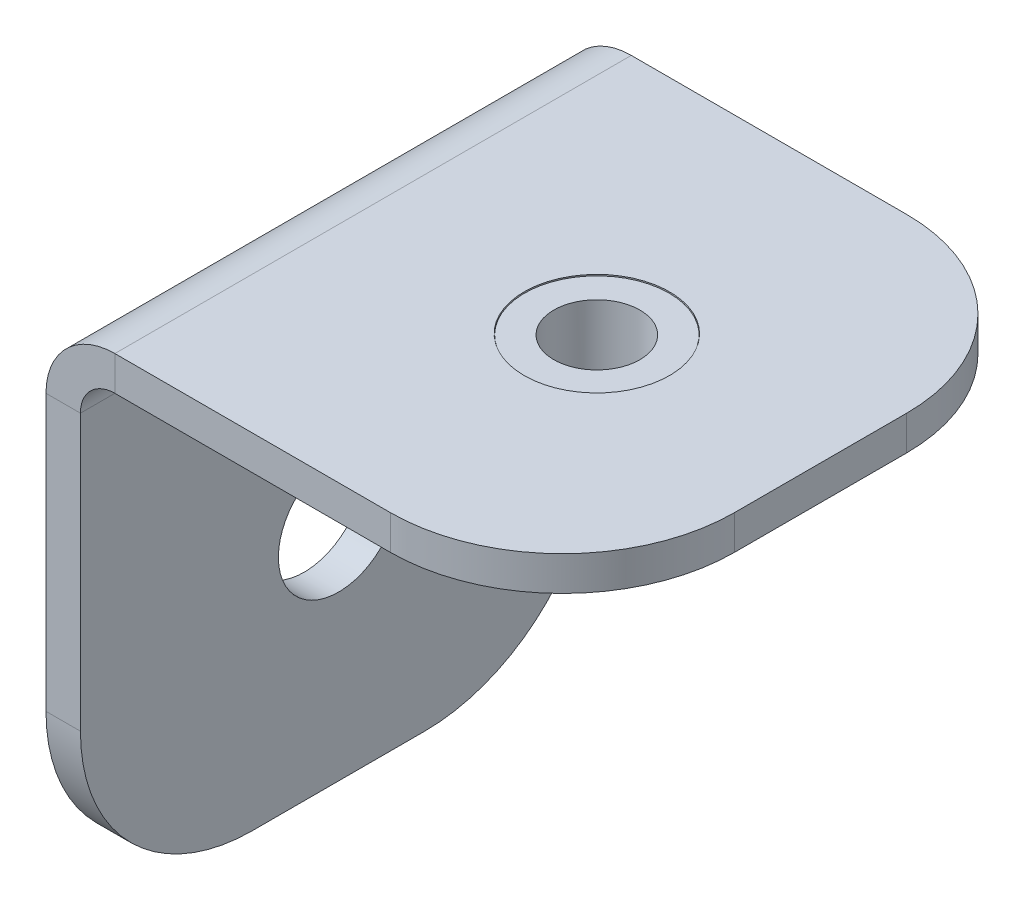
ISO-10303-21;
HEADER;
FILE_DESCRIPTION(('STEP AP214'),'2;1');
FILE_NAME('part.step','',(''),(''),'','','');
FILE_SCHEMA(('AUTOMOTIVE_DESIGN { 1 0 10303 214 1 1 1 1 }'));
ENDSEC;
DATA;
#1=APPLICATION_CONTEXT('core data for automotive mechanical design processes');
#2=APPLICATION_PROTOCOL_DEFINITION('international standard','automotive_design',2000,#1);
#3=PRODUCT_CONTEXT('',#1,'mechanical');
#4=PRODUCT('Part','Part','',(#3));
#5=PRODUCT_RELATED_PRODUCT_CATEGORY('part','',(#4));
#6=PRODUCT_DEFINITION_FORMATION('','',#4);
#7=PRODUCT_DEFINITION_CONTEXT('part definition',#1,'design');
#8=PRODUCT_DEFINITION('design','',#6,#7);
#9=PRODUCT_DEFINITION_SHAPE('','',#8);
#10=(LENGTH_UNIT() NAMED_UNIT(*) SI_UNIT(.MILLI.,.METRE.));
#11=(NAMED_UNIT(*) PLANE_ANGLE_UNIT() SI_UNIT($,.RADIAN.));
#12=(NAMED_UNIT(*) SI_UNIT($,.STERADIAN.) SOLID_ANGLE_UNIT());
#13=UNCERTAINTY_MEASURE_WITH_UNIT(LENGTH_MEASURE(1.E-05),#10,'distance_accuracy_value','');
#14=(GEOMETRIC_REPRESENTATION_CONTEXT(3) GLOBAL_UNCERTAINTY_ASSIGNED_CONTEXT((#13)) GLOBAL_UNIT_ASSIGNED_CONTEXT((#10,
#11,#12)) REPRESENTATION_CONTEXT('',''));
#15=CARTESIAN_POINT('',(0.,0.,0.));
#16=DIRECTION('',(0.,0.,1.));
#17=DIRECTION('',(1.,0.,0.));
#18=AXIS2_PLACEMENT_3D('',#15,#16,#17);
#19=CARTESIAN_POINT('',(8.5,12.5,7.5));
#20=DIRECTION('',(0.,1.,0.));
#21=DIRECTION('',(0.837169104331222,0.,0.546944138603989));
#22=AXIS2_PLACEMENT_3D('',#19,#20,#21);
#23=PLANE('',#22);
#24=CARTESIAN_POINT('',(8.5,12.5,7.5));
#25=DIRECTION('',(0.,-1.,0.));
#26=DIRECTION('',(0.546944138603989,0.,-0.837169104331222));
#27=AXIS2_PLACEMENT_3D('',#24,#25,#26);
#28=CIRCLE('',#27,1.24999999999999);
#29=CARTESIAN_POINT('',(9.18368017325498,12.5,6.45353861958598));
#30=VERTEX_POINT('',#29);
#31=EDGE_CURVE('E69',#30,#30,#28,.T.);
#32=ORIENTED_EDGE('',*,*,#31,.F.);
#33=EDGE_LOOP('',(#32));
#34=FACE_BOUND('',#33,.T.);
#35=CARTESIAN_POINT('',(8.5,12.5,7.5));
#36=DIRECTION('',(0.,-1.,0.));
#37=DIRECTION('',(-0.837169104331222,0.,-0.546944138603989));
#38=AXIS2_PLACEMENT_3D('',#35,#36,#37);
#39=CIRCLE('',#38,3.15);
#40=CARTESIAN_POINT('',(5.86291732135665,12.5,5.77712596339744));
#41=VERTEX_POINT('',#40);
#42=EDGE_CURVE('E11',#41,#41,#39,.T.);
#43=ORIENTED_EDGE('',*,*,#42,.T.);
#44=EDGE_LOOP('',(#43));
#45=FACE_BOUND('',#44,.T.);
#46=ADVANCED_FACE('F47',(#34,#45),#23,.F.);
#47=CARTESIAN_POINT('',(8.5,12.5,7.5));
#48=DIRECTION('',(0.,-1.,0.));
#49=DIRECTION('',(-0.837169104331222,0.,-0.546944138603989));
#50=AXIS2_PLACEMENT_3D('',#47,#48,#49);
#51=CYLINDRICAL_SURFACE('',#50,3.15);
#52=ORIENTED_EDGE('',*,*,#42,.F.);
#53=EDGE_LOOP('',(#52));
#54=FACE_BOUND('',#53,.T.);
#55=CARTESIAN_POINT('',(8.5,14.,7.5));
#56=DIRECTION('',(0.,-1.,0.));
#57=DIRECTION('',(-0.837169104331222,0.,-0.546944138603989));
#58=AXIS2_PLACEMENT_3D('',#55,#56,#57);
#59=CIRCLE('',#58,3.15);
#60=CARTESIAN_POINT('',(5.86291732135665,14.,5.77712596339744));
#61=VERTEX_POINT('',#60);
#62=EDGE_CURVE('E53',#61,#61,#59,.T.);
#63=ORIENTED_EDGE('',*,*,#62,.T.);
#64=EDGE_LOOP('',(#63));
#65=FACE_BOUND('',#64,.T.);
#66=ADVANCED_FACE('F77',(#54,#65),#51,.T.);
#67=CARTESIAN_POINT('',(11.1370826786433,14.,9.22287403660256));
#68=DIRECTION('',(0.,-1.,0.));
#69=DIRECTION('',(-0.837169104331222,0.,-0.546944138603989));
#70=AXIS2_PLACEMENT_3D('',#67,#68,#69);
#71=PLANE('',#70);
#72=ORIENTED_EDGE('',*,*,#62,.F.);
#73=EDGE_LOOP('',(#72));
#74=FACE_BOUND('',#73,.T.);
#75=CARTESIAN_POINT('',(8.5,14.,7.5));
#76=DIRECTION('',(0.,-1.,0.));
#77=DIRECTION('',(-0.837169104331222,0.,-0.546944138603989));
#78=AXIS2_PLACEMENT_3D('',#75,#76,#77);
#79=CIRCLE('',#78,2.1);
#80=CARTESIAN_POINT('',(6.74194488090443,14.,6.35141730893162));
#81=VERTEX_POINT('',#80);
#82=EDGE_CURVE('E57',#81,#81,#79,.T.);
#83=ORIENTED_EDGE('',*,*,#82,.T.);
#84=EDGE_LOOP('',(#83));
#85=FACE_BOUND('',#84,.T.);
#86=ADVANCED_FACE('F81',(#74,#85),#71,.F.);
#87=CARTESIAN_POINT('',(8.5,12.5,7.5));
#88=DIRECTION('',(0.,-1.,0.));
#89=DIRECTION('',(-0.837169104331222,0.,-0.546944138603989));
#90=AXIS2_PLACEMENT_3D('',#87,#88,#89);
#91=CYLINDRICAL_SURFACE('',#90,2.1);
#92=ORIENTED_EDGE('',*,*,#82,.F.);
#93=EDGE_LOOP('',(#92));
#94=FACE_BOUND('',#93,.T.);
#95=CARTESIAN_POINT('',(8.5,14.97,7.5));
#96=DIRECTION('',(0.,-1.,0.));
#97=DIRECTION('',(-0.837169104331222,0.,-0.546944138603989));
#98=AXIS2_PLACEMENT_3D('',#95,#96,#97);
#99=CIRCLE('',#98,2.1);
#100=CARTESIAN_POINT('',(6.74194488090443,14.97,6.35141730893162));
#101=VERTEX_POINT('',#100);
#102=EDGE_CURVE('E61',#101,#101,#99,.T.);
#103=ORIENTED_EDGE('',*,*,#102,.T.);
#104=EDGE_LOOP('',(#103));
#105=FACE_BOUND('',#104,.T.);
#106=ADVANCED_FACE('F86',(#94,#105),#91,.T.);
#107=CARTESIAN_POINT('',(10.2580551190956,14.97,8.64858269106838));
#108=DIRECTION('',(0.,-1.,0.));
#109=DIRECTION('',(-0.837169104331222,0.,-0.546944138603989));
#110=AXIS2_PLACEMENT_3D('',#107,#108,#109);
#111=PLANE('',#110);
#112=CARTESIAN_POINT('',(8.5,14.97,7.5));
#113=DIRECTION('',(0.,-1.,0.));
#114=DIRECTION('',(-0.837169104331222,0.,-0.546944138603989));
#115=AXIS2_PLACEMENT_3D('',#112,#113,#114);
#116=CIRCLE('',#115,1.24999999999999);
#117=CARTESIAN_POINT('',(7.45353861958598,14.97,6.81631982674502));
#118=VERTEX_POINT('',#117);
#119=EDGE_CURVE('E66',#118,#118,#116,.T.);
#120=ORIENTED_EDGE('',*,*,#119,.T.);
#121=EDGE_LOOP('',(#120));
#122=FACE_BOUND('',#121,.T.);
#123=ORIENTED_EDGE('',*,*,#102,.F.);
#124=EDGE_LOOP('',(#123));
#125=FACE_BOUND('',#124,.T.);
#126=ADVANCED_FACE('F92',(#122,#125),#111,.F.);
#127=CARTESIAN_POINT('',(8.5,12.5,7.5));
#128=DIRECTION('',(0.,-1.,0.));
#129=DIRECTION('',(0.546944138603989,0.,-0.837169104331222));
#130=AXIS2_PLACEMENT_3D('',#127,#128,#129);
#131=CYLINDRICAL_SURFACE('',#130,1.24999999999999);
#132=ORIENTED_EDGE('',*,*,#31,.T.);
#133=EDGE_LOOP('',(#132));
#134=FACE_BOUND('',#133,.T.);
#135=ORIENTED_EDGE('',*,*,#119,.F.);
#136=EDGE_LOOP('',(#135));
#137=FACE_BOUND('',#136,.T.);
#138=ADVANCED_FACE('F73',(#134,#137),#131,.F.);
#139=CLOSED_SHELL('',(#46,#66,#86,#106,#126,#138));
#140=MANIFOLD_SOLID_BREP('B2',#139);
#141=CARTESIAN_POINT('',(2.,15.,15.));
#142=DIRECTION('',(0.,0.,1.));
#143=DIRECTION('',(1.,0.,0.));
#144=AXIS2_PLACEMENT_3D('',#141,#142,#143);
#145=PLANE('',#144);
#146=DIRECTION('',(0.,-1.,0.));
#147=VECTOR('',#146,1.);
#148=CARTESIAN_POINT('',(2.,15.,15.));
#149=LINE('',#148,#147);
#150=CARTESIAN_POINT('',(2.,15.,15.));
#151=VERTEX_POINT('',#150);
#152=CARTESIAN_POINT('',(2.,14.,15.));
#153=VERTEX_POINT('',#152);
#154=EDGE_CURVE('E243',#151,#153,#149,.T.);
#155=ORIENTED_EDGE('',*,*,#154,.F.);
#156=CARTESIAN_POINT('',(2.,13.,15.));
#157=DIRECTION('',(0.,0.,1.));
#158=DIRECTION('',(1.,0.,0.));
#159=AXIS2_PLACEMENT_3D('',#156,#157,#158);
#160=CIRCLE('',#159,2.);
#161=CARTESIAN_POINT('',(0.,13.,15.));
#162=VERTEX_POINT('',#161);
#163=EDGE_CURVE('E247',#162,#151,#160,.F.);
#164=ORIENTED_EDGE('',*,*,#163,.F.);
#165=DIRECTION('',(-1.,0.,0.));
#166=VECTOR('',#165,1.);
#167=CARTESIAN_POINT('',(1.,13.,15.));
#168=LINE('',#167,#166);
#169=CARTESIAN_POINT('',(1.,13.,15.));
#170=VERTEX_POINT('',#169);
#171=EDGE_CURVE('E252',#170,#162,#168,.T.);
#172=ORIENTED_EDGE('',*,*,#171,.F.);
#173=CARTESIAN_POINT('',(2.,13.,15.));
#174=DIRECTION('',(0.,0.,1.));
#175=DIRECTION('',(1.,0.,0.));
#176=AXIS2_PLACEMENT_3D('',#173,#174,#175);
#177=CIRCLE('',#176,1.);
#178=EDGE_CURVE('E249',#170,#153,#177,.F.);
#179=ORIENTED_EDGE('',*,*,#178,.T.);
#180=EDGE_LOOP('',(#155,#164,#172,#179));
#181=FACE_BOUND('',#180,.T.);
#182=ADVANCED_FACE('F150',(#181),#145,.T.);
#183=CARTESIAN_POINT('',(1.,13.,15.));
#184=DIRECTION('',(0.,0.,1.));
#185=DIRECTION('',(1.,0.,0.));
#186=AXIS2_PLACEMENT_3D('',#183,#184,#185);
#187=PLANE('',#186);
#188=DIRECTION('',(1.,0.,0.));
#189=VECTOR('',#188,1.);
#190=CARTESIAN_POINT('',(0.,14.,15.));
#191=LINE('',#190,#189);
#192=CARTESIAN_POINT('',(10.,14.,15.));
#193=VERTEX_POINT('',#192);
#194=EDGE_CURVE('E267',#153,#193,#191,.T.);
#195=ORIENTED_EDGE('',*,*,#194,.T.);
#196=DIRECTION('',(0.,-1.,0.));
#197=VECTOR('',#196,1.);
#198=CARTESIAN_POINT('',(10.,13.,15.));
#199=LINE('',#198,#197);
#200=CARTESIAN_POINT('',(10.,15.,15.));
#201=VERTEX_POINT('',#200);
#202=EDGE_CURVE('E173',#193,#201,#199,.F.);
#203=ORIENTED_EDGE('',*,*,#202,.T.);
#204=DIRECTION('',(1.,0.,0.));
#205=VECTOR('',#204,1.);
#206=CARTESIAN_POINT('',(0.,15.,15.));
#207=LINE('',#206,#205);
#208=EDGE_CURVE('E257',#151,#201,#207,.T.);
#209=ORIENTED_EDGE('',*,*,#208,.F.);
#210=ORIENTED_EDGE('',*,*,#154,.T.);
#211=EDGE_LOOP('',(#195,#203,#209,#210));
#212=FACE_BOUND('',#211,.T.);
#213=ADVANCED_FACE('F266',(#212),#187,.T.);
#214=CARTESIAN_POINT('',(0.,13.,0.));
#215=DIRECTION('',(0.,0.,-1.));
#216=DIRECTION('',(-1.,0.,0.));
#217=AXIS2_PLACEMENT_3D('',#214,#215,#216);
#218=PLANE('',#217);
#219=DIRECTION('',(1.,0.,0.));
#220=VECTOR('',#219,1.);
#221=CARTESIAN_POINT('',(0.,13.,0.));
#222=LINE('',#221,#220);
#223=CARTESIAN_POINT('',(0.,13.,0.));
#224=VERTEX_POINT('',#223);
#225=CARTESIAN_POINT('',(1.,13.,0.));
#226=VERTEX_POINT('',#225);
#227=EDGE_CURVE('E313',#224,#226,#222,.T.);
#228=ORIENTED_EDGE('',*,*,#227,.F.);
#229=CARTESIAN_POINT('',(2.,13.,0.));
#230=DIRECTION('',(0.,0.,1.));
#231=DIRECTION('',(1.,0.,0.));
#232=AXIS2_PLACEMENT_3D('',#229,#230,#231);
#233=CIRCLE('',#232,2.);
#234=CARTESIAN_POINT('',(2.,15.,0.));
#235=VERTEX_POINT('',#234);
#236=EDGE_CURVE('E286',#224,#235,#233,.F.);
#237=ORIENTED_EDGE('',*,*,#236,.T.);
#238=DIRECTION('',(0.,1.,0.));
#239=VECTOR('',#238,1.);
#240=CARTESIAN_POINT('',(2.,14.,0.));
#241=LINE('',#240,#239);
#242=CARTESIAN_POINT('',(2.,14.,0.));
#243=VERTEX_POINT('',#242);
#244=EDGE_CURVE('E311',#243,#235,#241,.T.);
#245=ORIENTED_EDGE('',*,*,#244,.F.);
#246=CARTESIAN_POINT('',(2.,13.,0.));
#247=DIRECTION('',(0.,0.,1.));
#248=DIRECTION('',(1.,0.,0.));
#249=AXIS2_PLACEMENT_3D('',#246,#247,#248);
#250=CIRCLE('',#249,1.);
#251=EDGE_CURVE('E292',#226,#243,#250,.F.);
#252=ORIENTED_EDGE('',*,*,#251,.F.);
#253=EDGE_LOOP('',(#228,#237,#245,#252));
#254=FACE_BOUND('',#253,.T.);
#255=ADVANCED_FACE('F360',(#254),#218,.T.);
#256=CARTESIAN_POINT('',(2.,14.,0.));
#257=DIRECTION('',(0.,0.,-1.));
#258=DIRECTION('',(-1.,0.,0.));
#259=AXIS2_PLACEMENT_3D('',#256,#257,#258);
#260=PLANE('',#259);
#261=DIRECTION('',(0.,1.,0.));
#262=VECTOR('',#261,1.);
#263=CARTESIAN_POINT('',(1.,0.,0.));
#264=LINE('',#263,#262);
#265=CARTESIAN_POINT('',(1.,5.,0.));
#266=VERTEX_POINT('',#265);
#267=EDGE_CURVE('E290',#266,#226,#264,.T.);
#268=ORIENTED_EDGE('',*,*,#267,.F.);
#269=DIRECTION('',(-1.,0.,0.));
#270=VECTOR('',#269,1.);
#271=CARTESIAN_POINT('',(2.,5.,0.));
#272=LINE('',#271,#270);
#273=CARTESIAN_POINT('',(0.,5.,0.));
#274=VERTEX_POINT('',#273);
#275=EDGE_CURVE('E45',#266,#274,#272,.T.);
#276=ORIENTED_EDGE('',*,*,#275,.T.);
#277=DIRECTION('',(0.,1.,0.));
#278=VECTOR('',#277,1.);
#279=CARTESIAN_POINT('',(0.,0.,0.));
#280=LINE('',#279,#278);
#281=EDGE_CURVE('E288',#274,#224,#280,.T.);
#282=ORIENTED_EDGE('',*,*,#281,.T.);
#283=ORIENTED_EDGE('',*,*,#227,.T.);
#284=EDGE_LOOP('',(#268,#276,#282,#283));
#285=FACE_BOUND('',#284,.T.);
#286=ADVANCED_FACE('F377',(#285),#260,.T.);
#287=CARTESIAN_POINT('',(0.,14.,15.));
#288=DIRECTION('',(0.,1.,0.));
#289=DIRECTION('',(0.,0.,1.));
#290=AXIS2_PLACEMENT_3D('',#287,#288,#289);
#291=PLANE('',#290);
#292=CARTESIAN_POINT('',(8.5,14.,7.5));
#293=DIRECTION('',(0.,1.,0.));
#294=DIRECTION('',(0.,0.,1.));
#295=AXIS2_PLACEMENT_3D('',#292,#293,#294);
#296=CIRCLE('',#295,2.11);
#297=CARTESIAN_POINT('',(8.5,14.,9.61));
#298=VERTEX_POINT('',#297);
#299=EDGE_CURVE('E284',#298,#298,#296,.F.);
#300=ORIENTED_EDGE('',*,*,#299,.F.);
#301=EDGE_LOOP('',(#300));
#302=FACE_BOUND('',#301,.T.);
#303=DIRECTION('',(0.,0.,-1.));
#304=VECTOR('',#303,1.);
#305=CARTESIAN_POINT('',(15.,14.,15.));
#306=LINE('',#305,#304);
#307=CARTESIAN_POINT('',(15.,14.,10.));
#308=VERTEX_POINT('',#307);
#309=CARTESIAN_POINT('',(15.,14.,5.));
#310=VERTEX_POINT('',#309);
#311=EDGE_CURVE('E308',#308,#310,#306,.T.);
#312=ORIENTED_EDGE('',*,*,#311,.F.);
#313=CARTESIAN_POINT('',(10.,14.,10.));
#314=DIRECTION('',(0.,1.,0.));
#315=DIRECTION('',(0.,0.,1.));
#316=AXIS2_PLACEMENT_3D('',#313,#314,#315);
#317=CIRCLE('',#316,5.);
#318=EDGE_CURVE('E339',#308,#193,#317,.F.);
#319=ORIENTED_EDGE('',*,*,#318,.T.);
#320=ORIENTED_EDGE('',*,*,#194,.F.);
#321=DIRECTION('',(0.,0.,-1.));
#322=VECTOR('',#321,1.);
#323=CARTESIAN_POINT('',(2.,14.,15.));
#324=LINE('',#323,#322);
#325=EDGE_CURVE('E280',#153,#243,#324,.T.);
#326=ORIENTED_EDGE('',*,*,#325,.T.);
#327=DIRECTION('',(1.,0.,0.));
#328=VECTOR('',#327,1.);
#329=CARTESIAN_POINT('',(0.,14.,0.));
#330=LINE('',#329,#328);
#331=CARTESIAN_POINT('',(10.,14.,0.));
#332=VERTEX_POINT('',#331);
#333=EDGE_CURVE('E281',#243,#332,#330,.T.);
#334=ORIENTED_EDGE('',*,*,#333,.T.);
#335=CARTESIAN_POINT('',(10.,14.,5.));
#336=DIRECTION('',(0.,1.,0.));
#337=DIRECTION('',(0.,0.,1.));
#338=AXIS2_PLACEMENT_3D('',#335,#336,#337);
#339=CIRCLE('',#338,5.);
#340=EDGE_CURVE('E337',#332,#310,#339,.F.);
#341=ORIENTED_EDGE('',*,*,#340,.T.);
#342=EDGE_LOOP('',(#312,#319,#320,#326,#334,#341));
#343=FACE_BOUND('',#342,.T.);
#344=ADVANCED_FACE('F352',(#302,#343),#291,.F.);
#345=CARTESIAN_POINT('',(15.,15.,15.));
#346=DIRECTION('',(1.,0.,0.));
#347=DIRECTION('',(0.,0.,-1.));
#348=AXIS2_PLACEMENT_3D('',#345,#346,#347);
#349=PLANE('',#348);
#350=DIRECTION('',(0.,0.,-1.));
#351=VECTOR('',#350,1.);
#352=CARTESIAN_POINT('',(15.,15.,15.));
#353=LINE('',#352,#351);
#354=CARTESIAN_POINT('',(15.,15.,10.));
#355=VERTEX_POINT('',#354);
#356=CARTESIAN_POINT('',(15.,15.,5.));
#357=VERTEX_POINT('',#356);
#358=EDGE_CURVE('E263',#355,#357,#353,.T.);
#359=ORIENTED_EDGE('',*,*,#358,.F.);
#360=DIRECTION('',(0.,-1.,0.));
#361=VECTOR('',#360,1.);
#362=CARTESIAN_POINT('',(15.,15.,10.));
#363=LINE('',#362,#361);
#364=EDGE_CURVE('E334',#355,#308,#363,.T.);
#365=ORIENTED_EDGE('',*,*,#364,.T.);
#366=ORIENTED_EDGE('',*,*,#311,.T.);
#367=DIRECTION('',(0.,-1.,0.));
#368=VECTOR('',#367,1.);
#369=CARTESIAN_POINT('',(15.,15.,5.));
#370=LINE('',#369,#368);
#371=EDGE_CURVE('E332',#310,#357,#370,.F.);
#372=ORIENTED_EDGE('',*,*,#371,.T.);
#373=EDGE_LOOP('',(#359,#365,#366,#372));
#374=FACE_BOUND('',#373,.T.);
#375=ADVANCED_FACE('F413',(#374),#349,.T.);
#376=CARTESIAN_POINT('',(0.,15.,15.));
#377=DIRECTION('',(0.,1.,0.));
#378=DIRECTION('',(0.,0.,1.));
#379=AXIS2_PLACEMENT_3D('',#376,#377,#378);
#380=PLANE('',#379);
#381=CARTESIAN_POINT('',(8.5,15.,7.5));
#382=DIRECTION('',(0.,1.,0.));
#383=DIRECTION('',(0.,0.,1.));
#384=AXIS2_PLACEMENT_3D('',#381,#382,#383);
#385=CIRCLE('',#384,2.11);
#386=CARTESIAN_POINT('',(8.5,15.,9.61));
#387=VERTEX_POINT('',#386);
#388=EDGE_CURVE('E444',#387,#387,#385,.T.);
#389=ORIENTED_EDGE('',*,*,#388,.F.);
#390=EDGE_LOOP('',(#389));
#391=FACE_BOUND('',#390,.T.);
#392=ORIENTED_EDGE('',*,*,#208,.T.);
#393=CARTESIAN_POINT('',(10.,15.,10.));
#394=DIRECTION('',(0.,1.,0.));
#395=DIRECTION('',(0.,0.,1.));
#396=AXIS2_PLACEMENT_3D('',#393,#394,#395);
#397=CIRCLE('',#396,5.);
#398=EDGE_CURVE('E343',#201,#355,#397,.T.);
#399=ORIENTED_EDGE('',*,*,#398,.T.);
#400=ORIENTED_EDGE('',*,*,#358,.T.);
#401=CARTESIAN_POINT('',(10.,15.,5.));
#402=DIRECTION('',(0.,1.,0.));
#403=DIRECTION('',(0.,0.,1.));
#404=AXIS2_PLACEMENT_3D('',#401,#402,#403);
#405=CIRCLE('',#404,5.);
#406=CARTESIAN_POINT('',(10.,15.,0.));
#407=VERTEX_POINT('',#406);
#408=EDGE_CURVE('E165',#357,#407,#405,.T.);
#409=ORIENTED_EDGE('',*,*,#408,.T.);
#410=DIRECTION('',(1.,0.,0.));
#411=VECTOR('',#410,1.);
#412=CARTESIAN_POINT('',(0.,15.,0.));
#413=LINE('',#412,#411);
#414=EDGE_CURVE('E259',#235,#407,#413,.T.);
#415=ORIENTED_EDGE('',*,*,#414,.F.);
#416=DIRECTION('',(0.,0.,-1.));
#417=VECTOR('',#416,1.);
#418=CARTESIAN_POINT('',(2.,15.,15.));
#419=LINE('',#418,#417);
#420=EDGE_CURVE('E255',#151,#235,#419,.T.);
#421=ORIENTED_EDGE('',*,*,#420,.F.);
#422=EDGE_LOOP('',(#392,#399,#400,#409,#415,#421));
#423=FACE_BOUND('',#422,.T.);
#424=ADVANCED_FACE('F256',(#391,#423),#380,.T.);
#425=CARTESIAN_POINT('',(2.,13.,15.));
#426=DIRECTION('',(0.,0.,-1.));
#427=DIRECTION('',(-1.,0.,0.));
#428=AXIS2_PLACEMENT_3D('',#425,#426,#427);
#429=CYLINDRICAL_SURFACE('',#428,2.);
#430=ORIENTED_EDGE('',*,*,#236,.F.);
#431=DIRECTION('',(0.,0.,-1.));
#432=VECTOR('',#431,1.);
#433=CARTESIAN_POINT('',(0.,13.,15.));
#434=LINE('',#433,#432);
#435=EDGE_CURVE('E264',#162,#224,#434,.T.);
#436=ORIENTED_EDGE('',*,*,#435,.F.);
#437=ORIENTED_EDGE('',*,*,#163,.T.);
#438=ORIENTED_EDGE('',*,*,#420,.T.);
#439=EDGE_LOOP('',(#430,#436,#437,#438));
#440=FACE_BOUND('',#439,.T.);
#441=ADVANCED_FACE('F270',(#440),#429,.T.);
#442=CARTESIAN_POINT('',(0.,0.,15.));
#443=DIRECTION('',(-1.,0.,0.));
#444=DIRECTION('',(0.,0.,1.));
#445=AXIS2_PLACEMENT_3D('',#442,#443,#444);
#446=PLANE('',#445);
#447=CARTESIAN_POINT('',(0.,6.5,7.5));
#448=DIRECTION('',(-1.,0.,0.));
#449=DIRECTION('',(0.,0.,1.));
#450=AXIS2_PLACEMENT_3D('',#447,#448,#449);
#451=CIRCLE('',#450,1.75);
#452=CARTESIAN_POINT('',(0.,6.5,9.25));
#453=VERTEX_POINT('',#452);
#454=EDGE_CURVE('E604',#453,#453,#451,.T.);
#455=ORIENTED_EDGE('',*,*,#454,.F.);
#456=EDGE_LOOP('',(#455));
#457=FACE_BOUND('',#456,.T.);
#458=DIRECTION('',(0.,0.,-1.));
#459=VECTOR('',#458,1.);
#460=CARTESIAN_POINT('',(0.,0.,15.));
#461=LINE('',#460,#459);
#462=CARTESIAN_POINT('',(0.,0.,10.));
#463=VERTEX_POINT('',#462);
#464=CARTESIAN_POINT('',(0.,0.,5.));
#465=VERTEX_POINT('',#464);
#466=EDGE_CURVE('E303',#463,#465,#461,.T.);
#467=ORIENTED_EDGE('',*,*,#466,.F.);
#468=CARTESIAN_POINT('',(0.,5.,10.));
#469=DIRECTION('',(-1.,0.,0.));
#470=DIRECTION('',(0.,0.,1.));
#471=AXIS2_PLACEMENT_3D('',#468,#469,#470);
#472=CIRCLE('',#471,5.);
#473=CARTESIAN_POINT('',(0.,5.,15.));
#474=VERTEX_POINT('',#473);
#475=EDGE_CURVE('E324',#463,#474,#472,.T.);
#476=ORIENTED_EDGE('',*,*,#475,.T.);
#477=DIRECTION('',(0.,1.,0.));
#478=VECTOR('',#477,1.);
#479=CARTESIAN_POINT('',(0.,0.,15.));
#480=LINE('',#479,#478);
#481=EDGE_CURVE('E272',#474,#162,#480,.T.);
#482=ORIENTED_EDGE('',*,*,#481,.T.);
#483=ORIENTED_EDGE('',*,*,#435,.T.);
#484=ORIENTED_EDGE('',*,*,#281,.F.);
#485=CARTESIAN_POINT('',(0.,5.,5.));
#486=DIRECTION('',(-1.,0.,0.));
#487=DIRECTION('',(0.,0.,1.));
#488=AXIS2_PLACEMENT_3D('',#485,#486,#487);
#489=CIRCLE('',#488,5.);
#490=EDGE_CURVE('E322',#274,#465,#489,.T.);
#491=ORIENTED_EDGE('',*,*,#490,.T.);
#492=EDGE_LOOP('',(#467,#476,#482,#483,#484,#491));
#493=FACE_BOUND('',#492,.T.);
#494=ADVANCED_FACE('F366',(#457,#493),#446,.T.);
#495=CARTESIAN_POINT('',(1.,0.,15.));
#496=DIRECTION('',(0.,-1.,0.));
#497=DIRECTION('',(0.,0.,-1.));
#498=AXIS2_PLACEMENT_3D('',#495,#496,#497);
#499=PLANE('',#498);
#500=DIRECTION('',(0.,0.,-1.));
#501=VECTOR('',#500,1.);
#502=CARTESIAN_POINT('',(1.,0.,15.));
#503=LINE('',#502,#501);
#504=CARTESIAN_POINT('',(1.,0.,10.));
#505=VERTEX_POINT('',#504);
#506=CARTESIAN_POINT('',(1.,0.,5.));
#507=VERTEX_POINT('',#506);
#508=EDGE_CURVE('E300',#505,#507,#503,.T.);
#509=ORIENTED_EDGE('',*,*,#508,.F.);
#510=DIRECTION('',(-1.,0.,0.));
#511=VECTOR('',#510,1.);
#512=CARTESIAN_POINT('',(1.,0.,10.));
#513=LINE('',#512,#511);
#514=EDGE_CURVE('E319',#505,#463,#513,.T.);
#515=ORIENTED_EDGE('',*,*,#514,.T.);
#516=ORIENTED_EDGE('',*,*,#466,.T.);
#517=DIRECTION('',(-1.,0.,0.));
#518=VECTOR('',#517,1.);
#519=CARTESIAN_POINT('',(1.,0.,5.));
#520=LINE('',#519,#518);
#521=EDGE_CURVE('E251',#465,#507,#520,.F.);
#522=ORIENTED_EDGE('',*,*,#521,.T.);
#523=EDGE_LOOP('',(#509,#515,#516,#522));
#524=FACE_BOUND('',#523,.T.);
#525=ADVANCED_FACE('F382',(#524),#499,.T.);
#526=CARTESIAN_POINT('',(1.,0.,15.));
#527=DIRECTION('',(-1.,0.,0.));
#528=DIRECTION('',(0.,0.,1.));
#529=AXIS2_PLACEMENT_3D('',#526,#527,#528);
#530=PLANE('',#529);
#531=CARTESIAN_POINT('',(0.999999999999999,6.5,7.5));
#532=DIRECTION('',(-1.,0.,0.));
#533=DIRECTION('',(0.,0.,1.));
#534=AXIS2_PLACEMENT_3D('',#531,#532,#533);
#535=CIRCLE('',#534,1.75);
#536=CARTESIAN_POINT('',(0.999999999999999,6.5,9.25));
#537=VERTEX_POINT('',#536);
#538=EDGE_CURVE('E448',#537,#537,#535,.F.);
#539=ORIENTED_EDGE('',*,*,#538,.F.);
#540=EDGE_LOOP('',(#539));
#541=FACE_BOUND('',#540,.T.);
#542=DIRECTION('',(0.,1.,0.));
#543=VECTOR('',#542,1.);
#544=CARTESIAN_POINT('',(1.,0.,15.));
#545=LINE('',#544,#543);
#546=CARTESIAN_POINT('',(1.,5.,15.));
#547=VERTEX_POINT('',#546);
#548=EDGE_CURVE('E274',#547,#170,#545,.T.);
#549=ORIENTED_EDGE('',*,*,#548,.F.);
#550=CARTESIAN_POINT('',(1.,5.,10.));
#551=DIRECTION('',(-1.,0.,0.));
#552=DIRECTION('',(0.,0.,1.));
#553=AXIS2_PLACEMENT_3D('',#550,#551,#552);
#554=CIRCLE('',#553,5.);
#555=EDGE_CURVE('E330',#547,#505,#554,.F.);
#556=ORIENTED_EDGE('',*,*,#555,.T.);
#557=ORIENTED_EDGE('',*,*,#508,.T.);
#558=CARTESIAN_POINT('',(1.,5.,5.));
#559=DIRECTION('',(-1.,0.,0.));
#560=DIRECTION('',(0.,0.,1.));
#561=AXIS2_PLACEMENT_3D('',#558,#559,#560);
#562=CIRCLE('',#561,5.);
#563=EDGE_CURVE('E328',#507,#266,#562,.F.);
#564=ORIENTED_EDGE('',*,*,#563,.T.);
#565=ORIENTED_EDGE('',*,*,#267,.T.);
#566=DIRECTION('',(0.,0.,-1.));
#567=VECTOR('',#566,1.);
#568=CARTESIAN_POINT('',(1.,13.,15.));
#569=LINE('',#568,#567);
#570=EDGE_CURVE('E297',#170,#226,#569,.T.);
#571=ORIENTED_EDGE('',*,*,#570,.F.);
#572=EDGE_LOOP('',(#549,#556,#557,#564,#565,#571));
#573=FACE_BOUND('',#572,.T.);
#574=ADVANCED_FACE('F373',(#541,#573),#530,.F.);
#575=CARTESIAN_POINT('',(2.,13.,15.));
#576=DIRECTION('',(0.,0.,-1.));
#577=DIRECTION('',(-1.,0.,0.));
#578=AXIS2_PLACEMENT_3D('',#575,#576,#577);
#579=CYLINDRICAL_SURFACE('',#578,1.);
#580=ORIENTED_EDGE('',*,*,#251,.T.);
#581=ORIENTED_EDGE('',*,*,#325,.F.);
#582=ORIENTED_EDGE('',*,*,#178,.F.);
#583=ORIENTED_EDGE('',*,*,#570,.T.);
#584=EDGE_LOOP('',(#580,#581,#582,#583));
#585=FACE_BOUND('',#584,.T.);
#586=ADVANCED_FACE('F355',(#585),#579,.F.);
#587=CARTESIAN_POINT('',(2.,13.,15.));
#588=DIRECTION('',(0.,0.,1.));
#589=DIRECTION('',(1.,0.,0.));
#590=AXIS2_PLACEMENT_3D('',#587,#588,#589);
#591=PLANE('',#590);
#592=ORIENTED_EDGE('',*,*,#481,.F.);
#593=DIRECTION('',(-1.,0.,0.));
#594=VECTOR('',#593,1.);
#595=CARTESIAN_POINT('',(2.,5.,15.));
#596=LINE('',#595,#594);
#597=EDGE_CURVE('E326',#474,#547,#596,.F.);
#598=ORIENTED_EDGE('',*,*,#597,.T.);
#599=ORIENTED_EDGE('',*,*,#548,.T.);
#600=ORIENTED_EDGE('',*,*,#171,.T.);
#601=EDGE_LOOP('',(#592,#598,#599,#600));
#602=FACE_BOUND('',#601,.T.);
#603=ADVANCED_FACE('F370',(#602),#591,.T.);
#604=CARTESIAN_POINT('',(2.,13.,0.));
#605=DIRECTION('',(0.,0.,1.));
#606=DIRECTION('',(1.,0.,0.));
#607=AXIS2_PLACEMENT_3D('',#604,#605,#606);
#608=PLANE('',#607);
#609=ORIENTED_EDGE('',*,*,#414,.T.);
#610=DIRECTION('',(0.,-1.,0.));
#611=VECTOR('',#610,1.);
#612=CARTESIAN_POINT('',(10.,14.,0.));
#613=LINE('',#612,#611);
#614=EDGE_CURVE('E158',#407,#332,#613,.T.);
#615=ORIENTED_EDGE('',*,*,#614,.T.);
#616=ORIENTED_EDGE('',*,*,#333,.F.);
#617=ORIENTED_EDGE('',*,*,#244,.T.);
#618=EDGE_LOOP('',(#609,#615,#616,#617));
#619=FACE_BOUND('',#618,.T.);
#620=ADVANCED_FACE('F348',(#619),#608,.F.);
#621=CARTESIAN_POINT('',(8.5,-0.000999999999999265,7.5));
#622=DIRECTION('',(0.,1.,0.));
#623=DIRECTION('',(0.,0.,1.));
#624=AXIS2_PLACEMENT_3D('',#621,#622,#623);
#625=CYLINDRICAL_SURFACE('',#624,2.11);
#626=ORIENTED_EDGE('',*,*,#388,.T.);
#627=EDGE_LOOP('',(#626));
#628=FACE_BOUND('',#627,.T.);
#629=ORIENTED_EDGE('',*,*,#299,.T.);
#630=EDGE_LOOP('',(#629));
#631=FACE_BOUND('',#630,.T.);
#632=ADVANCED_FACE('F397',(#628,#631),#625,.F.);
#633=CARTESIAN_POINT('',(15.001,6.5,7.5));
#634=DIRECTION('',(-1.,0.,0.));
#635=DIRECTION('',(0.,0.,1.));
#636=AXIS2_PLACEMENT_3D('',#633,#634,#635);
#637=CYLINDRICAL_SURFACE('',#636,1.75);
#638=ORIENTED_EDGE('',*,*,#454,.T.);
#639=EDGE_LOOP('',(#638));
#640=FACE_BOUND('',#639,.T.);
#641=ORIENTED_EDGE('',*,*,#538,.T.);
#642=EDGE_LOOP('',(#641));
#643=FACE_BOUND('',#642,.T.);
#644=ADVANCED_FACE('F388',(#640,#643),#637,.F.);
#645=CARTESIAN_POINT('',(1.,5.,10.));
#646=DIRECTION('',(-1.,0.,0.));
#647=DIRECTION('',(0.,0.,1.));
#648=AXIS2_PLACEMENT_3D('',#645,#646,#647);
#649=CYLINDRICAL_SURFACE('',#648,5.);
#650=ORIENTED_EDGE('',*,*,#555,.F.);
#651=ORIENTED_EDGE('',*,*,#597,.F.);
#652=ORIENTED_EDGE('',*,*,#475,.F.);
#653=ORIENTED_EDGE('',*,*,#514,.F.);
#654=EDGE_LOOP('',(#650,#651,#652,#653));
#655=FACE_BOUND('',#654,.T.);
#656=ADVANCED_FACE('F385',(#655),#649,.T.);
#657=CARTESIAN_POINT('',(10.,15.,10.));
#658=DIRECTION('',(0.,-1.,0.));
#659=DIRECTION('',(0.,0.,-1.));
#660=AXIS2_PLACEMENT_3D('',#657,#658,#659);
#661=CYLINDRICAL_SURFACE('',#660,5.);
#662=ORIENTED_EDGE('',*,*,#398,.F.);
#663=ORIENTED_EDGE('',*,*,#202,.F.);
#664=ORIENTED_EDGE('',*,*,#318,.F.);
#665=ORIENTED_EDGE('',*,*,#364,.F.);
#666=EDGE_LOOP('',(#662,#663,#664,#665));
#667=FACE_BOUND('',#666,.T.);
#668=ADVANCED_FACE('F387',(#667),#661,.T.);
#669=CARTESIAN_POINT('',(10.,13.,5.));
#670=DIRECTION('',(0.,1.,0.));
#671=DIRECTION('',(0.,0.,1.));
#672=AXIS2_PLACEMENT_3D('',#669,#670,#671);
#673=CYLINDRICAL_SURFACE('',#672,5.);
#674=ORIENTED_EDGE('',*,*,#408,.F.);
#675=ORIENTED_EDGE('',*,*,#371,.F.);
#676=ORIENTED_EDGE('',*,*,#340,.F.);
#677=ORIENTED_EDGE('',*,*,#614,.F.);
#678=EDGE_LOOP('',(#674,#675,#676,#677));
#679=FACE_BOUND('',#678,.T.);
#680=ADVANCED_FACE('F394',(#679),#673,.T.);
#681=CARTESIAN_POINT('',(2.,5.,5.));
#682=DIRECTION('',(-1.,0.,0.));
#683=DIRECTION('',(0.,0.,1.));
#684=AXIS2_PLACEMENT_3D('',#681,#682,#683);
#685=CYLINDRICAL_SURFACE('',#684,5.);
#686=ORIENTED_EDGE('',*,*,#563,.F.);
#687=ORIENTED_EDGE('',*,*,#521,.F.);
#688=ORIENTED_EDGE('',*,*,#490,.F.);
#689=ORIENTED_EDGE('',*,*,#275,.F.);
#690=EDGE_LOOP('',(#686,#687,#688,#689));
#691=FACE_BOUND('',#690,.T.);
#692=ADVANCED_FACE('F152',(#691),#685,.T.);
#693=CLOSED_SHELL('',(#182,#213,#255,#286,#344,#375,#424,#441,#494,#525,#574,#586,#603,#620,
#632,#644,#656,#668,#680,#692));
#694=MANIFOLD_SOLID_BREP('B6',#693);
#695=ADVANCED_BREP_SHAPE_REPRESENTATION('',(#18,#140,#694),#14);
#696=SHAPE_DEFINITION_REPRESENTATION(#9,#695);
ENDSEC;
END-ISO-10303-21;
